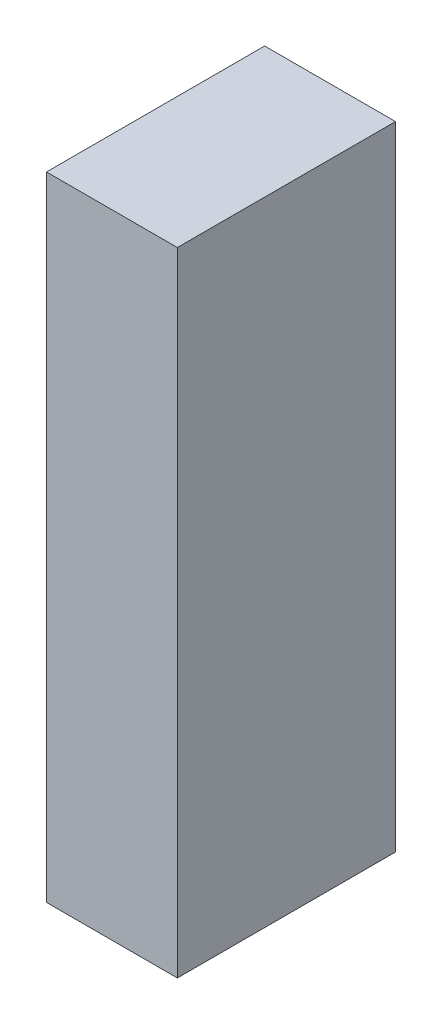
ISO-10303-21;
HEADER;
FILE_DESCRIPTION(('STEP AP214'),'2;1');
FILE_NAME('part.step','',(''),(''),'','','');
FILE_SCHEMA(('AUTOMOTIVE_DESIGN { 1 0 10303 214 1 1 1 1 }'));
ENDSEC;
DATA;
#1=APPLICATION_CONTEXT('core data for automotive mechanical design processes');
#2=APPLICATION_PROTOCOL_DEFINITION('international standard','automotive_design',2000,#1);
#3=PRODUCT_CONTEXT('',#1,'mechanical');
#4=PRODUCT('Part','Part','',(#3));
#5=PRODUCT_RELATED_PRODUCT_CATEGORY('part','',(#4));
#6=PRODUCT_DEFINITION_FORMATION('','',#4);
#7=PRODUCT_DEFINITION_CONTEXT('part definition',#1,'design');
#8=PRODUCT_DEFINITION('design','',#6,#7);
#9=PRODUCT_DEFINITION_SHAPE('','',#8);
#10=(LENGTH_UNIT() NAMED_UNIT(*) SI_UNIT(.MILLI.,.METRE.));
#11=(NAMED_UNIT(*) PLANE_ANGLE_UNIT() SI_UNIT($,.RADIAN.));
#12=(NAMED_UNIT(*) SI_UNIT($,.STERADIAN.) SOLID_ANGLE_UNIT());
#13=UNCERTAINTY_MEASURE_WITH_UNIT(LENGTH_MEASURE(1.E-05),#10,'distance_accuracy_value','');
#14=(GEOMETRIC_REPRESENTATION_CONTEXT(3) GLOBAL_UNCERTAINTY_ASSIGNED_CONTEXT((#13)) GLOBAL_UNIT_ASSIGNED_CONTEXT((#10,
#11,#12)) REPRESENTATION_CONTEXT('',''));
#15=CARTESIAN_POINT('',(0.,0.,0.));
#16=DIRECTION('',(0.,0.,1.));
#17=DIRECTION('',(1.,0.,0.));
#18=AXIS2_PLACEMENT_3D('',#15,#16,#17);
#19=CARTESIAN_POINT('',(0.800018310546875,-0.724998474121094,-2.64111989736557));
#20=DIRECTION('',(0.,-1.,0.));
#21=DIRECTION('',(1.,0.,0.));
#22=AXIS2_PLACEMENT_3D('',#19,#20,#21);
#23=PLANE('',#22);
#24=DIRECTION('',(1.,0.,0.));
#25=VECTOR('',#24,1.);
#26=CARTESIAN_POINT('',(0.800018310546875,-0.724998474121094,-2.64111989736557));
#27=LINE('',#26,#25);
#28=CARTESIAN_POINT('',(0.800018310546875,-0.724998474121094,-2.64111989736557));
#29=VERTEX_POINT('',#28);
#30=CARTESIAN_POINT('',(1.0999755859375,-0.724998474121094,-2.64111989736557));
#31=VERTEX_POINT('',#30);
#32=EDGE_CURVE('E11',#29,#31,#27,.T.);
#33=ORIENTED_EDGE('',*,*,#32,.T.);
#34=DIRECTION('',(0.,0.,1.));
#35=VECTOR('',#34,1.);
#36=CARTESIAN_POINT('',(1.0999755859375,-0.724998474121094,-2.64111989736557));
#37=LINE('',#36,#35);
#38=CARTESIAN_POINT('',(1.0999755859375,-0.724998474121094,-2.14112091064453));
#39=VERTEX_POINT('',#38);
#40=EDGE_CURVE('E88',#31,#39,#37,.T.);
#41=ORIENTED_EDGE('',*,*,#40,.T.);
#42=DIRECTION('',(1.,0.,0.));
#43=VECTOR('',#42,1.);
#44=CARTESIAN_POINT('',(0.800018310546875,-0.724998474121094,-2.14112091064453));
#45=LINE('',#44,#43);
#46=CARTESIAN_POINT('',(0.800018310546875,-0.724998474121094,-2.14112091064453));
#47=VERTEX_POINT('',#46);
#48=EDGE_CURVE('E83',#47,#39,#45,.T.);
#49=ORIENTED_EDGE('',*,*,#48,.F.);
#50=DIRECTION('',(0.,0.,1.));
#51=VECTOR('',#50,1.);
#52=CARTESIAN_POINT('',(0.800018310546875,-0.724998474121094,-2.64111989736557));
#53=LINE('',#52,#51);
#54=EDGE_CURVE('E72',#29,#47,#53,.T.);
#55=ORIENTED_EDGE('',*,*,#54,.F.);
#56=EDGE_LOOP('',(#33,#41,#49,#55));
#57=FACE_BOUND('',#56,.T.);
#58=ADVANCED_FACE('F17',(#57),#23,.T.);
#59=CARTESIAN_POINT('',(1.0999755859375,-0.724998474121094,-2.64111989736557));
#60=DIRECTION('',(1.,0.,0.));
#61=DIRECTION('',(0.,1.,0.));
#62=AXIS2_PLACEMENT_3D('',#59,#60,#61);
#63=PLANE('',#62);
#64=DIRECTION('',(0.,1.,0.));
#65=VECTOR('',#64,1.);
#66=CARTESIAN_POINT('',(1.0999755859375,-0.724998474121094,-2.64111989736557));
#67=LINE('',#66,#65);
#68=CARTESIAN_POINT('',(1.0999755859375,0.724998474121094,-2.64111989736557));
#69=VERTEX_POINT('',#68);
#70=EDGE_CURVE('E24',#31,#69,#67,.T.);
#71=ORIENTED_EDGE('',*,*,#70,.T.);
#72=DIRECTION('',(0.,0.,1.));
#73=VECTOR('',#72,1.);
#74=CARTESIAN_POINT('',(1.0999755859375,0.724998474121094,-2.64111989736557));
#75=LINE('',#74,#73);
#76=CARTESIAN_POINT('',(1.0999755859375,0.724998474121094,-2.14112091064453));
#77=VERTEX_POINT('',#76);
#78=EDGE_CURVE('E85',#69,#77,#75,.T.);
#79=ORIENTED_EDGE('',*,*,#78,.T.);
#80=DIRECTION('',(0.,1.,0.));
#81=VECTOR('',#80,1.);
#82=CARTESIAN_POINT('',(1.0999755859375,-0.724998474121094,-2.14112091064453));
#83=LINE('',#82,#81);
#84=EDGE_CURVE('E66',#39,#77,#83,.T.);
#85=ORIENTED_EDGE('',*,*,#84,.F.);
#86=ORIENTED_EDGE('',*,*,#40,.F.);
#87=EDGE_LOOP('',(#71,#79,#85,#86));
#88=FACE_BOUND('',#87,.T.);
#89=ADVANCED_FACE('F89',(#88),#63,.T.);
#90=CARTESIAN_POINT('',(1.0999755859375,0.724998474121094,-2.64111989736557));
#91=DIRECTION('',(0.,1.,0.));
#92=DIRECTION('',(-1.,0.,0.));
#93=AXIS2_PLACEMENT_3D('',#90,#91,#92);
#94=PLANE('',#93);
#95=DIRECTION('',(-1.,0.,0.));
#96=VECTOR('',#95,1.);
#97=CARTESIAN_POINT('',(1.0999755859375,0.724998474121094,-2.64111989736557));
#98=LINE('',#97,#96);
#99=CARTESIAN_POINT('',(0.800018310546875,0.724998474121094,-2.64111989736557));
#100=VERTEX_POINT('',#99);
#101=EDGE_CURVE('E62',#69,#100,#98,.T.);
#102=ORIENTED_EDGE('',*,*,#101,.T.);
#103=DIRECTION('',(0.,0.,1.));
#104=VECTOR('',#103,1.);
#105=CARTESIAN_POINT('',(0.800018310546875,0.724998474121094,-2.64111989736557));
#106=LINE('',#105,#104);
#107=CARTESIAN_POINT('',(0.800018310546875,0.724998474121094,-2.14112091064453));
#108=VERTEX_POINT('',#107);
#109=EDGE_CURVE('E55',#100,#108,#106,.T.);
#110=ORIENTED_EDGE('',*,*,#109,.T.);
#111=DIRECTION('',(-1.,0.,0.));
#112=VECTOR('',#111,1.);
#113=CARTESIAN_POINT('',(1.0999755859375,0.724998474121094,-2.14112091064453));
#114=LINE('',#113,#112);
#115=EDGE_CURVE('E59',#77,#108,#114,.T.);
#116=ORIENTED_EDGE('',*,*,#115,.F.);
#117=ORIENTED_EDGE('',*,*,#78,.F.);
#118=EDGE_LOOP('',(#102,#110,#116,#117));
#119=FACE_BOUND('',#118,.T.);
#120=ADVANCED_FACE('F57',(#119),#94,.T.);
#121=CARTESIAN_POINT('',(0.800018310546875,0.724998474121094,-2.64111989736557));
#122=DIRECTION('',(-1.,0.,0.));
#123=DIRECTION('',(0.,-1.,0.));
#124=AXIS2_PLACEMENT_3D('',#121,#122,#123);
#125=PLANE('',#124);
#126=DIRECTION('',(0.,-1.,0.));
#127=VECTOR('',#126,1.);
#128=CARTESIAN_POINT('',(0.800018310546875,0.724998474121094,-2.64111989736557));
#129=LINE('',#128,#127);
#130=EDGE_CURVE('E65',#100,#29,#129,.T.);
#131=ORIENTED_EDGE('',*,*,#130,.T.);
#132=ORIENTED_EDGE('',*,*,#54,.T.);
#133=DIRECTION('',(0.,-1.,0.));
#134=VECTOR('',#133,1.);
#135=CARTESIAN_POINT('',(0.800018310546875,0.724998474121094,-2.14112091064453));
#136=LINE('',#135,#134);
#137=EDGE_CURVE('E70',#108,#47,#136,.T.);
#138=ORIENTED_EDGE('',*,*,#137,.F.);
#139=ORIENTED_EDGE('',*,*,#109,.F.);
#140=EDGE_LOOP('',(#131,#132,#138,#139));
#141=FACE_BOUND('',#140,.T.);
#142=ADVANCED_FACE('F71',(#141),#125,.T.);
#143=CARTESIAN_POINT('',(-376.649993896484,-95.8000030517578,-2.14112091064453));
#144=DIRECTION('',(0.,0.,1.));
#145=DIRECTION('',(1.,0.,0.));
#146=AXIS2_PLACEMENT_3D('',#143,#144,#145);
#147=PLANE('',#146);
#148=ORIENTED_EDGE('',*,*,#48,.T.);
#149=ORIENTED_EDGE('',*,*,#84,.T.);
#150=ORIENTED_EDGE('',*,*,#115,.T.);
#151=ORIENTED_EDGE('',*,*,#137,.T.);
#152=EDGE_LOOP('',(#148,#149,#150,#151));
#153=FACE_BOUND('',#152,.T.);
#154=ADVANCED_FACE('F76',(#153),#147,.T.);
#155=CARTESIAN_POINT('',(-376.649993896484,-95.8000030517578,-2.64111989736557));
#156=DIRECTION('',(0.,0.,1.));
#157=DIRECTION('',(1.,0.,0.));
#158=AXIS2_PLACEMENT_3D('',#155,#156,#157);
#159=PLANE('',#158);
#160=ORIENTED_EDGE('',*,*,#130,.F.);
#161=ORIENTED_EDGE('',*,*,#101,.F.);
#162=ORIENTED_EDGE('',*,*,#70,.F.);
#163=ORIENTED_EDGE('',*,*,#32,.F.);
#164=EDGE_LOOP('',(#160,#161,#162,#163));
#165=FACE_BOUND('',#164,.T.);
#166=ADVANCED_FACE('F91',(#165),#159,.F.);
#167=CLOSED_SHELL('',(#58,#89,#120,#142,#154,#166));
#168=MANIFOLD_SOLID_BREP('B1',#167);
#169=ADVANCED_BREP_SHAPE_REPRESENTATION('',(#18,#168),#14);
#170=SHAPE_DEFINITION_REPRESENTATION(#9,#169);
ENDSEC;
END-ISO-10303-21;
